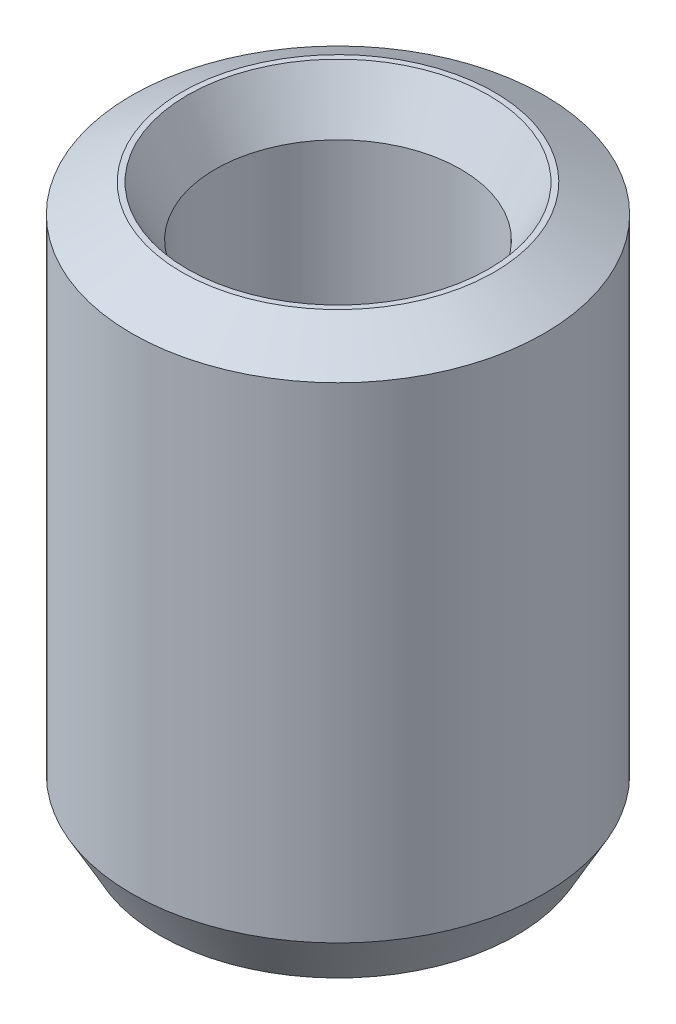
ISO-10303-21;
HEADER;
FILE_DESCRIPTION(('STEP AP214'),'2;1');
FILE_NAME('part.step','',(''),(''),'','','');
FILE_SCHEMA(('AUTOMOTIVE_DESIGN { 1 0 10303 214 1 1 1 1 }'));
ENDSEC;
DATA;
#1=APPLICATION_CONTEXT('core data for automotive mechanical design processes');
#2=APPLICATION_PROTOCOL_DEFINITION('international standard','automotive_design',2000,#1);
#3=PRODUCT_CONTEXT('',#1,'mechanical');
#4=PRODUCT('Part','Part','',(#3));
#5=PRODUCT_RELATED_PRODUCT_CATEGORY('part','',(#4));
#6=PRODUCT_DEFINITION_FORMATION('','',#4);
#7=PRODUCT_DEFINITION_CONTEXT('part definition',#1,'design');
#8=PRODUCT_DEFINITION('design','',#6,#7);
#9=PRODUCT_DEFINITION_SHAPE('','',#8);
#10=(LENGTH_UNIT() NAMED_UNIT(*) SI_UNIT(.MILLI.,.METRE.));
#11=(NAMED_UNIT(*) PLANE_ANGLE_UNIT() SI_UNIT($,.RADIAN.));
#12=(NAMED_UNIT(*) SI_UNIT($,.STERADIAN.) SOLID_ANGLE_UNIT());
#13=UNCERTAINTY_MEASURE_WITH_UNIT(LENGTH_MEASURE(1.E-05),#10,'distance_accuracy_value','');
#14=(GEOMETRIC_REPRESENTATION_CONTEXT(3) GLOBAL_UNCERTAINTY_ASSIGNED_CONTEXT((#13)) GLOBAL_UNIT_ASSIGNED_CONTEXT((#10,
#11,#12)) REPRESENTATION_CONTEXT('',''));
#15=CARTESIAN_POINT('',(0.,0.,0.));
#16=DIRECTION('',(0.,0.,1.));
#17=DIRECTION('',(1.,0.,0.));
#18=AXIS2_PLACEMENT_3D('',#15,#16,#17);
#19=CARTESIAN_POINT('',(0.,34.1359759783743,0.));
#20=DIRECTION('',(0.,-1.,0.));
#21=DIRECTION('',(0.,0.,-1.));
#22=AXIS2_PLACEMENT_3D('',#19,#20,#21);
#23=CYLINDRICAL_SURFACE('',#22,12.5);
#24=CARTESIAN_POINT('',(0.,3.03580690220596,0.));
#25=DIRECTION('',(0.,1.,0.));
#26=DIRECTION('',(0.,0.,1.));
#27=AXIS2_PLACEMENT_3D('',#24,#25,#26);
#28=CIRCLE('',#27,12.5);
#29=CARTESIAN_POINT('',(0.,3.03580690220596,12.5));
#30=VERTEX_POINT('',#29);
#31=EDGE_CURVE('E10',#30,#30,#28,.T.);
#32=ORIENTED_EDGE('',*,*,#31,.T.);
#33=EDGE_LOOP('',(#32));
#34=FACE_BOUND('',#33,.T.);
#35=CARTESIAN_POINT('',(0.,32.4417688358162,0.));
#36=DIRECTION('',(0.,1.,0.));
#37=DIRECTION('',(0.,0.,1.));
#38=AXIS2_PLACEMENT_3D('',#35,#36,#37);
#39=CIRCLE('',#38,12.5);
#40=CARTESIAN_POINT('',(0.,32.4417688358162,12.5));
#41=VERTEX_POINT('',#40);
#42=EDGE_CURVE('E50',#41,#41,#39,.F.);
#43=ORIENTED_EDGE('',*,*,#42,.T.);
#44=EDGE_LOOP('',(#43));
#45=FACE_BOUND('',#44,.T.);
#46=ADVANCED_FACE('F39',(#34,#45),#23,.T.);
#47=CARTESIAN_POINT('',(0.,34.1359759783743,0.));
#48=DIRECTION('',(0.,1.,0.));
#49=DIRECTION('',(0.,0.,1.));
#50=AXIS2_PLACEMENT_3D('',#47,#48,#49);
#51=PLANE('',#50);
#52=CARTESIAN_POINT('',(0.,34.1359759783743,0.));
#53=DIRECTION('',(0.,1.,0.));
#54=DIRECTION('',(0.,0.,1.));
#55=AXIS2_PLACEMENT_3D('',#52,#53,#54);
#56=CIRCLE('',#55,9.12858164182757);
#57=CARTESIAN_POINT('',(0.,34.1359759783743,9.12858164182757));
#58=VERTEX_POINT('',#57);
#59=EDGE_CURVE('E58',#58,#58,#56,.F.);
#60=ORIENTED_EDGE('',*,*,#59,.T.);
#61=EDGE_LOOP('',(#60));
#62=FACE_BOUND('',#61,.T.);
#63=CARTESIAN_POINT('',(0.,34.1359759783743,0.));
#64=DIRECTION('',(0.,1.,0.));
#65=DIRECTION('',(0.,0.,1.));
#66=AXIS2_PLACEMENT_3D('',#63,#64,#65);
#67=CIRCLE('',#66,9.46419309779405);
#68=CARTESIAN_POINT('',(0.,34.1359759783743,9.46419309779405));
#69=VERTEX_POINT('',#68);
#70=EDGE_CURVE('E61',#69,#69,#67,.T.);
#71=ORIENTED_EDGE('',*,*,#70,.T.);
#72=EDGE_LOOP('',(#71));
#73=FACE_BOUND('',#72,.T.);
#74=ADVANCED_FACE('F88',(#62,#73),#51,.T.);
#75=CARTESIAN_POINT('',(0.,0.,0.));
#76=DIRECTION('',(0.,1.,0.));
#77=DIRECTION('',(0.,0.,1.));
#78=AXIS2_PLACEMENT_3D('',#75,#76,#77);
#79=PLANE('',#78);
#80=CARTESIAN_POINT('',(0.,0.,0.));
#81=DIRECTION('',(0.,1.,0.));
#82=DIRECTION('',(0.,0.,1.));
#83=AXIS2_PLACEMENT_3D('',#80,#81,#82);
#84=CIRCLE('',#83,10.4701814014754);
#85=CARTESIAN_POINT('',(0.,0.,10.4701814014754));
#86=VERTEX_POINT('',#85);
#87=EDGE_CURVE('E51',#86,#86,#84,.T.);
#88=ORIENTED_EDGE('',*,*,#87,.T.);
#89=EDGE_LOOP('',(#88));
#90=FACE_BOUND('',#89,.T.);
#91=CARTESIAN_POINT('',(0.,0.,0.));
#92=DIRECTION('',(0.,1.,0.));
#93=DIRECTION('',(0.,0.,1.));
#94=AXIS2_PLACEMENT_3D('',#91,#92,#93);
#95=CIRCLE('',#94,10.8057928574419);
#96=CARTESIAN_POINT('',(0.,0.,10.8057928574419));
#97=VERTEX_POINT('',#96);
#98=EDGE_CURVE('E54',#97,#97,#95,.F.);
#99=ORIENTED_EDGE('',*,*,#98,.T.);
#100=EDGE_LOOP('',(#99));
#101=FACE_BOUND('',#100,.T.);
#102=ADVANCED_FACE('F83',(#90,#101),#79,.F.);
#103=CARTESIAN_POINT('',(0.,34.1359759783743,0.));
#104=DIRECTION('',(0.,-1.,0.));
#105=DIRECTION('',(0.,0.,-1.));
#106=AXIS2_PLACEMENT_3D('',#103,#104,#105);
#107=CYLINDRICAL_SURFACE('',#106,7.43437449926945);
#108=CARTESIAN_POINT('',(0.,31.1001690761684,0.));
#109=DIRECTION('',(0.,1.,0.));
#110=DIRECTION('',(0.,0.,1.));
#111=AXIS2_PLACEMENT_3D('',#108,#109,#110);
#112=CIRCLE('',#111,7.43437449926945);
#113=CARTESIAN_POINT('',(0.,31.1001690761684,7.43437449926945));
#114=VERTEX_POINT('',#113);
#115=EDGE_CURVE('E67',#114,#114,#112,.T.);
#116=ORIENTED_EDGE('',*,*,#115,.T.);
#117=EDGE_LOOP('',(#116));
#118=FACE_BOUND('',#117,.T.);
#119=CARTESIAN_POINT('',(0.,1.69420714255813,0.));
#120=DIRECTION('',(0.,1.,0.));
#121=DIRECTION('',(0.,0.,1.));
#122=AXIS2_PLACEMENT_3D('',#119,#120,#121);
#123=CIRCLE('',#122,7.43437449926945);
#124=CARTESIAN_POINT('',(0.,1.69420714255813,7.43437449926945));
#125=VERTEX_POINT('',#124);
#126=EDGE_CURVE('E69',#125,#125,#123,.F.);
#127=ORIENTED_EDGE('',*,*,#126,.T.);
#128=EDGE_LOOP('',(#127));
#129=FACE_BOUND('',#128,.T.);
#130=ADVANCED_FACE('F71',(#118,#129),#107,.F.);
#131=CARTESIAN_POINT('',(0.,31.1001690761684,0.));
#132=DIRECTION('',(0.,1.,0.));
#133=DIRECTION('',(0.,0.,1.));
#134=AXIS2_PLACEMENT_3D('',#131,#132,#133);
#135=CONICAL_SURFACE('',#134,7.43437449926945,0.509021481355082);
#136=ORIENTED_EDGE('',*,*,#59,.F.);
#137=EDGE_LOOP('',(#136));
#138=FACE_BOUND('',#137,.T.);
#139=ORIENTED_EDGE('',*,*,#115,.F.);
#140=EDGE_LOOP('',(#139));
#141=FACE_BOUND('',#140,.T.);
#142=ADVANCED_FACE('F77',(#138,#141),#135,.F.);
#143=CARTESIAN_POINT('',(0.,0.,0.));
#144=DIRECTION('',(0.,-1.,0.));
#145=DIRECTION('',(0.,0.,-1.));
#146=AXIS2_PLACEMENT_3D('',#143,#144,#145);
#147=CONICAL_SURFACE('',#146,10.4701814014754,1.06177484543981);
#148=ORIENTED_EDGE('',*,*,#126,.F.);
#149=EDGE_LOOP('',(#148));
#150=FACE_BOUND('',#149,.T.);
#151=ORIENTED_EDGE('',*,*,#87,.F.);
#152=EDGE_LOOP('',(#151));
#153=FACE_BOUND('',#152,.T.);
#154=ADVANCED_FACE('F73',(#150,#153),#147,.F.);
#155=CARTESIAN_POINT('',(0.,3.03580690220596,0.));
#156=DIRECTION('',(0.,1.,0.));
#157=DIRECTION('',(0.,0.,1.));
#158=AXIS2_PLACEMENT_3D('',#155,#156,#157);
#159=CONICAL_SURFACE('',#158,12.5,0.509021481355084);
#160=ORIENTED_EDGE('',*,*,#98,.F.);
#161=EDGE_LOOP('',(#160));
#162=FACE_BOUND('',#161,.T.);
#163=ORIENTED_EDGE('',*,*,#31,.F.);
#164=EDGE_LOOP('',(#163));
#165=FACE_BOUND('',#164,.T.);
#166=ADVANCED_FACE('F76',(#162,#165),#159,.T.);
#167=CARTESIAN_POINT('',(0.,34.1359759783743,0.));
#168=DIRECTION('',(0.,-1.,0.));
#169=DIRECTION('',(0.,0.,-1.));
#170=AXIS2_PLACEMENT_3D('',#167,#168,#169);
#171=CONICAL_SURFACE('',#170,9.46419309779405,1.06177484543981);
#172=ORIENTED_EDGE('',*,*,#42,.F.);
#173=EDGE_LOOP('',(#172));
#174=FACE_BOUND('',#173,.T.);
#175=ORIENTED_EDGE('',*,*,#70,.F.);
#176=EDGE_LOOP('',(#175));
#177=FACE_BOUND('',#176,.T.);
#178=ADVANCED_FACE('F45',(#174,#177),#171,.T.);
#179=CLOSED_SHELL('',(#46,#74,#102,#130,#142,#154,#166,#178));
#180=MANIFOLD_SOLID_BREP('B2',#179);
#181=ADVANCED_BREP_SHAPE_REPRESENTATION('',(#18,#180),#14);
#182=SHAPE_DEFINITION_REPRESENTATION(#9,#181);
ENDSEC;
END-ISO-10303-21;
